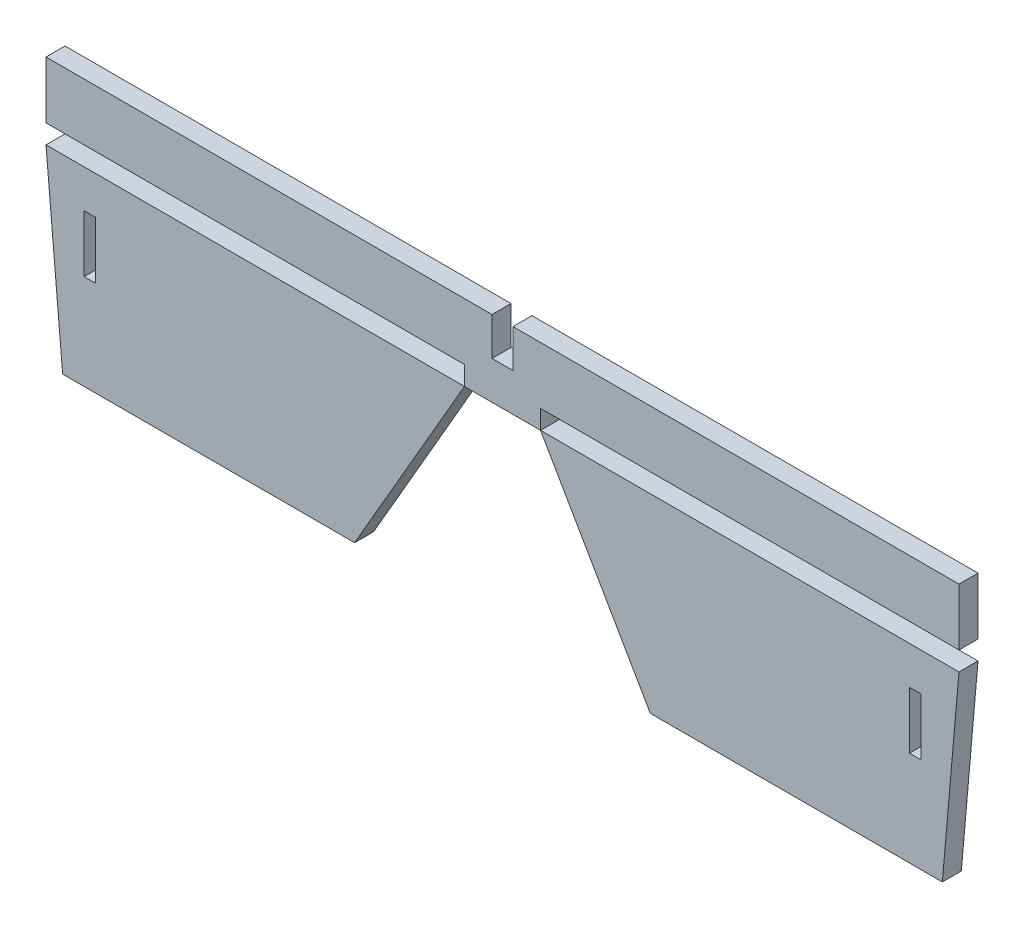
ISO-10303-21;
HEADER;
FILE_DESCRIPTION(('STEP AP214'),'2;1');
FILE_NAME('part.step','',(''),(''),'','','');
FILE_SCHEMA(('AUTOMOTIVE_DESIGN { 1 0 10303 214 1 1 1 1 }'));
ENDSEC;
DATA;
#1=APPLICATION_CONTEXT('core data for automotive mechanical design processes');
#2=APPLICATION_PROTOCOL_DEFINITION('international standard','automotive_design',2000,#1);
#3=PRODUCT_CONTEXT('',#1,'mechanical');
#4=PRODUCT('Part','Part','',(#3));
#5=PRODUCT_RELATED_PRODUCT_CATEGORY('part','',(#4));
#6=PRODUCT_DEFINITION_FORMATION('','',#4);
#7=PRODUCT_DEFINITION_CONTEXT('part definition',#1,'design');
#8=PRODUCT_DEFINITION('design','',#6,#7);
#9=PRODUCT_DEFINITION_SHAPE('','',#8);
#10=(LENGTH_UNIT() NAMED_UNIT(*) SI_UNIT(.MILLI.,.METRE.));
#11=(NAMED_UNIT(*) PLANE_ANGLE_UNIT() SI_UNIT($,.RADIAN.));
#12=(NAMED_UNIT(*) SI_UNIT($,.STERADIAN.) SOLID_ANGLE_UNIT());
#13=UNCERTAINTY_MEASURE_WITH_UNIT(LENGTH_MEASURE(1.E-05),#10,'distance_accuracy_value','');
#14=(GEOMETRIC_REPRESENTATION_CONTEXT(3) GLOBAL_UNCERTAINTY_ASSIGNED_CONTEXT((#13)) GLOBAL_UNIT_ASSIGNED_CONTEXT((#10,
#11,#12)) REPRESENTATION_CONTEXT('',''));
#15=CARTESIAN_POINT('',(0.,0.,0.));
#16=DIRECTION('',(0.,0.,1.));
#17=DIRECTION('',(1.,0.,0.));
#18=AXIS2_PLACEMENT_3D('',#15,#16,#17);
#19=CARTESIAN_POINT('',(0.,-20.,2.5));
#20=DIRECTION('',(0.,1.,0.));
#21=DIRECTION('',(0.,0.,1.));
#22=AXIS2_PLACEMENT_3D('',#19,#20,#21);
#23=PLANE('',#22);
#24=DIRECTION('',(-1.,0.,0.));
#25=VECTOR('',#24,1.);
#26=CARTESIAN_POINT('',(0.,-20.,-2.5));
#27=LINE('',#26,#25);
#28=CARTESIAN_POINT('',(110.,-20.,-2.5));
#29=VERTEX_POINT('',#28);
#30=CARTESIAN_POINT('',(107.,-20.,-2.5));
#31=VERTEX_POINT('',#30);
#32=EDGE_CURVE('E154',#29,#31,#27,.T.);
#33=ORIENTED_EDGE('',*,*,#32,.F.);
#34=DIRECTION('',(0.,0.,-1.));
#35=VECTOR('',#34,1.);
#36=CARTESIAN_POINT('',(110.,-20.,2.5));
#37=LINE('',#36,#35);
#38=CARTESIAN_POINT('',(110.,-20.,2.5));
#39=VERTEX_POINT('',#38);
#40=EDGE_CURVE('E161',#39,#29,#37,.T.);
#41=ORIENTED_EDGE('',*,*,#40,.F.);
#42=DIRECTION('',(-1.,0.,0.));
#43=VECTOR('',#42,1.);
#44=CARTESIAN_POINT('',(0.,-20.,2.5));
#45=LINE('',#44,#43);
#46=CARTESIAN_POINT('',(107.,-20.,2.5));
#47=VERTEX_POINT('',#46);
#48=EDGE_CURVE('E136',#39,#47,#45,.T.);
#49=ORIENTED_EDGE('',*,*,#48,.T.);
#50=DIRECTION('',(0.,0.,-1.));
#51=VECTOR('',#50,1.);
#52=CARTESIAN_POINT('',(107.,-20.,2.5));
#53=LINE('',#52,#51);
#54=EDGE_CURVE('E12',#47,#31,#53,.T.);
#55=ORIENTED_EDGE('',*,*,#54,.T.);
#56=EDGE_LOOP('',(#33,#41,#49,#55));
#57=FACE_BOUND('',#56,.T.);
#58=ADVANCED_FACE('F46',(#57),#23,.F.);
#59=CARTESIAN_POINT('',(107.,0.,2.5));
#60=DIRECTION('',(-1.,0.,0.));
#61=DIRECTION('',(0.,0.,-1.));
#62=AXIS2_PLACEMENT_3D('',#59,#60,#61);
#63=PLANE('',#62);
#64=DIRECTION('',(0.,-1.,0.));
#65=VECTOR('',#64,1.);
#66=CARTESIAN_POINT('',(107.,0.,-2.5));
#67=LINE('',#66,#65);
#68=CARTESIAN_POINT('',(107.,-35.,-2.5));
#69=VERTEX_POINT('',#68);
#70=EDGE_CURVE('E156',#31,#69,#67,.T.);
#71=ORIENTED_EDGE('',*,*,#70,.F.);
#72=ORIENTED_EDGE('',*,*,#54,.F.);
#73=DIRECTION('',(0.,-1.,0.));
#74=VECTOR('',#73,1.);
#75=CARTESIAN_POINT('',(107.,0.,2.5));
#76=LINE('',#75,#74);
#77=CARTESIAN_POINT('',(107.,-35.,2.5));
#78=VERTEX_POINT('',#77);
#79=EDGE_CURVE('E123',#47,#78,#76,.T.);
#80=ORIENTED_EDGE('',*,*,#79,.T.);
#81=DIRECTION('',(0.,0.,-1.));
#82=VECTOR('',#81,1.);
#83=CARTESIAN_POINT('',(107.,-35.,2.5));
#84=LINE('',#83,#82);
#85=EDGE_CURVE('E56',#78,#69,#84,.T.);
#86=ORIENTED_EDGE('',*,*,#85,.T.);
#87=EDGE_LOOP('',(#71,#72,#80,#86));
#88=FACE_BOUND('',#87,.T.);
#89=ADVANCED_FACE('F134',(#88),#63,.F.);
#90=CARTESIAN_POINT('',(0.,-35.,2.5));
#91=DIRECTION('',(0.,1.,0.));
#92=DIRECTION('',(0.,0.,1.));
#93=AXIS2_PLACEMENT_3D('',#90,#91,#92);
#94=PLANE('',#93);
#95=DIRECTION('',(-1.,0.,0.));
#96=VECTOR('',#95,1.);
#97=CARTESIAN_POINT('',(0.,-35.,-2.5));
#98=LINE('',#97,#96);
#99=CARTESIAN_POINT('',(110.,-35.,-2.5));
#100=VERTEX_POINT('',#99);
#101=EDGE_CURVE('E129',#100,#69,#98,.T.);
#102=ORIENTED_EDGE('',*,*,#101,.T.);
#103=ORIENTED_EDGE('',*,*,#85,.F.);
#104=DIRECTION('',(-1.,0.,0.));
#105=VECTOR('',#104,1.);
#106=CARTESIAN_POINT('',(0.,-35.,2.5));
#107=LINE('',#106,#105);
#108=CARTESIAN_POINT('',(110.,-35.,2.5));
#109=VERTEX_POINT('',#108);
#110=EDGE_CURVE('E119',#109,#78,#107,.T.);
#111=ORIENTED_EDGE('',*,*,#110,.F.);
#112=DIRECTION('',(0.,0.,-1.));
#113=VECTOR('',#112,1.);
#114=CARTESIAN_POINT('',(110.,-35.,2.5));
#115=LINE('',#114,#113);
#116=EDGE_CURVE('E132',#109,#100,#115,.T.);
#117=ORIENTED_EDGE('',*,*,#116,.T.);
#118=EDGE_LOOP('',(#102,#103,#111,#117));
#119=FACE_BOUND('',#118,.T.);
#120=ADVANCED_FACE('F128',(#119),#94,.T.);
#121=CARTESIAN_POINT('',(119.956706069067,-10.4948518949548,2.5));
#122=DIRECTION('',(-0.996194698091746,0.0871557427476584,0.));
#123=DIRECTION('',(0.0871557427476584,0.996194698091746,0.));
#124=AXIS2_PLACEMENT_3D('',#121,#122,#123);
#125=PLANE('',#124);
#126=DIRECTION('',(-0.0871557427476584,-0.996194698091746,0.));
#127=VECTOR('',#126,1.);
#128=CARTESIAN_POINT('',(119.956706069067,-10.4948518949548,-2.5));
#129=LINE('',#128,#127);
#130=CARTESIAN_POINT('',(120.,-10.,-2.5));
#131=VERTEX_POINT('',#130);
#132=CARTESIAN_POINT('',(115.625566823704,-60.,-2.5));
#133=VERTEX_POINT('',#132);
#134=EDGE_CURVE('E144',#131,#133,#129,.T.);
#135=ORIENTED_EDGE('',*,*,#134,.F.);
#136=DIRECTION('',(0.,0.,-1.));
#137=VECTOR('',#136,1.);
#138=CARTESIAN_POINT('',(120.,-10.,2.5));
#139=LINE('',#138,#137);
#140=CARTESIAN_POINT('',(120.,-10.,2.5));
#141=VERTEX_POINT('',#140);
#142=EDGE_CURVE('E143',#141,#131,#139,.T.);
#143=ORIENTED_EDGE('',*,*,#142,.F.);
#144=DIRECTION('',(-0.0871557427476584,-0.996194698091746,0.));
#145=VECTOR('',#144,1.);
#146=CARTESIAN_POINT('',(119.956706069067,-10.4948518949548,2.5));
#147=LINE('',#146,#145);
#148=CARTESIAN_POINT('',(115.625566823704,-60.,2.5));
#149=VERTEX_POINT('',#148);
#150=EDGE_CURVE('E160',#141,#149,#147,.T.);
#151=ORIENTED_EDGE('',*,*,#150,.T.);
#152=DIRECTION('',(0.,0.,-1.));
#153=VECTOR('',#152,1.);
#154=CARTESIAN_POINT('',(115.625566823704,-60.,2.5));
#155=LINE('',#154,#153);
#156=EDGE_CURVE('E50',#149,#133,#155,.T.);
#157=ORIENTED_EDGE('',*,*,#156,.T.);
#158=EDGE_LOOP('',(#135,#143,#151,#157));
#159=FACE_BOUND('',#158,.T.);
#160=ADVANCED_FACE('F48',(#159),#125,.F.);
#161=CARTESIAN_POINT('',(0.,-60.,2.5));
#162=DIRECTION('',(0.,1.,0.));
#163=DIRECTION('',(1.,0.,0.));
#164=AXIS2_PLACEMENT_3D('',#161,#162,#163);
#165=PLANE('',#164);
#166=DIRECTION('',(-1.,0.,0.));
#167=VECTOR('',#166,1.);
#168=CARTESIAN_POINT('',(0.,-60.,-2.5));
#169=LINE('',#168,#167);
#170=CARTESIAN_POINT('',(38.8675134594816,-60.,-2.5));
#171=VERTEX_POINT('',#170);
#172=EDGE_CURVE('E147',#133,#171,#169,.T.);
#173=ORIENTED_EDGE('',*,*,#172,.F.);
#174=ORIENTED_EDGE('',*,*,#156,.F.);
#175=DIRECTION('',(-1.,0.,0.));
#176=VECTOR('',#175,1.);
#177=CARTESIAN_POINT('',(0.,-60.,2.5));
#178=LINE('',#177,#176);
#179=CARTESIAN_POINT('',(38.8675134594816,-60.,2.5));
#180=VERTEX_POINT('',#179);
#181=EDGE_CURVE('E104',#149,#180,#178,.T.);
#182=ORIENTED_EDGE('',*,*,#181,.T.);
#183=DIRECTION('',(0.,0.,-1.));
#184=VECTOR('',#183,1.);
#185=CARTESIAN_POINT('',(38.8675134594816,-60.,2.5));
#186=LINE('',#185,#184);
#187=EDGE_CURVE('E168',#180,#171,#186,.T.);
#188=ORIENTED_EDGE('',*,*,#187,.T.);
#189=EDGE_LOOP('',(#173,#174,#182,#188));
#190=FACE_BOUND('',#189,.T.);
#191=ADVANCED_FACE('F190',(#190),#165,.F.);
#192=CARTESIAN_POINT('',(3.16987298107774,1.83012701892218,2.5));
#193=DIRECTION('',(-0.866025403784436,-0.500000000000004,0.));
#194=DIRECTION('',(-0.500000000000004,0.866025403784436,0.));
#195=AXIS2_PLACEMENT_3D('',#192,#193,#194);
#196=PLANE('',#195);
#197=DIRECTION('',(0.500000000000004,-0.866025403784436,0.));
#198=VECTOR('',#197,1.);
#199=CARTESIAN_POINT('',(3.16987298107774,1.83012701892218,-2.5));
#200=LINE('',#199,#198);
#201=CARTESIAN_POINT('',(10.,-10.,-2.5));
#202=VERTEX_POINT('',#201);
#203=EDGE_CURVE('E150',#202,#171,#200,.T.);
#204=ORIENTED_EDGE('',*,*,#203,.T.);
#205=ORIENTED_EDGE('',*,*,#187,.F.);
#206=DIRECTION('',(0.500000000000004,-0.866025403784436,0.));
#207=VECTOR('',#206,1.);
#208=CARTESIAN_POINT('',(3.16987298107774,1.83012701892218,2.5));
#209=LINE('',#208,#207);
#210=CARTESIAN_POINT('',(10.,-10.,2.5));
#211=VERTEX_POINT('',#210);
#212=EDGE_CURVE('E184',#211,#180,#209,.T.);
#213=ORIENTED_EDGE('',*,*,#212,.F.);
#214=DIRECTION('',(0.,0.,-1.));
#215=VECTOR('',#214,1.);
#216=CARTESIAN_POINT('',(10.,-10.,2.5));
#217=LINE('',#216,#215);
#218=EDGE_CURVE('E166',#211,#202,#217,.T.);
#219=ORIENTED_EDGE('',*,*,#218,.T.);
#220=EDGE_LOOP('',(#204,#205,#213,#219));
#221=FACE_BOUND('',#220,.T.);
#222=ADVANCED_FACE('F189',(#221),#196,.T.);
#223=CARTESIAN_POINT('',(0.,-10.,2.5));
#224=DIRECTION('',(0.,1.,0.));
#225=DIRECTION('',(0.,0.,1.));
#226=AXIS2_PLACEMENT_3D('',#223,#224,#225);
#227=PLANE('',#226);
#228=DIRECTION('',(-1.,0.,0.));
#229=VECTOR('',#228,1.);
#230=CARTESIAN_POINT('',(0.,-10.,-2.5));
#231=LINE('',#230,#229);
#232=EDGE_CURVE('E152',#131,#202,#231,.T.);
#233=ORIENTED_EDGE('',*,*,#232,.T.);
#234=ORIENTED_EDGE('',*,*,#218,.F.);
#235=DIRECTION('',(-1.,0.,0.));
#236=VECTOR('',#235,1.);
#237=CARTESIAN_POINT('',(0.,-10.,2.5));
#238=LINE('',#237,#236);
#239=EDGE_CURVE('E138',#141,#211,#238,.T.);
#240=ORIENTED_EDGE('',*,*,#239,.F.);
#241=ORIENTED_EDGE('',*,*,#142,.T.);
#242=EDGE_LOOP('',(#233,#234,#240,#241));
#243=FACE_BOUND('',#242,.T.);
#244=ADVANCED_FACE('F182',(#243),#227,.T.);
#245=CARTESIAN_POINT('',(110.,0.,2.5));
#246=DIRECTION('',(-1.,0.,0.));
#247=DIRECTION('',(0.,0.,-1.));
#248=AXIS2_PLACEMENT_3D('',#245,#246,#247);
#249=PLANE('',#248);
#250=DIRECTION('',(0.,-1.,0.));
#251=VECTOR('',#250,1.);
#252=CARTESIAN_POINT('',(110.,0.,-2.5));
#253=LINE('',#252,#251);
#254=EDGE_CURVE('E91',#29,#100,#253,.T.);
#255=ORIENTED_EDGE('',*,*,#254,.T.);
#256=ORIENTED_EDGE('',*,*,#116,.F.);
#257=DIRECTION('',(0.,-1.,0.));
#258=VECTOR('',#257,1.);
#259=CARTESIAN_POINT('',(110.,0.,2.5));
#260=LINE('',#259,#258);
#261=EDGE_CURVE('E65',#39,#109,#260,.T.);
#262=ORIENTED_EDGE('',*,*,#261,.F.);
#263=ORIENTED_EDGE('',*,*,#40,.T.);
#264=EDGE_LOOP('',(#255,#256,#262,#263));
#265=FACE_BOUND('',#264,.T.);
#266=ADVANCED_FACE('F208',(#265),#249,.T.);
#267=CARTESIAN_POINT('',(0.,0.,2.5));
#268=DIRECTION('',(0.,0.,1.));
#269=DIRECTION('',(-1.,0.,0.));
#270=AXIS2_PLACEMENT_3D('',#267,#268,#269);
#271=PLANE('',#270);
#272=ORIENTED_EDGE('',*,*,#150,.F.);
#273=ORIENTED_EDGE('',*,*,#239,.T.);
#274=ORIENTED_EDGE('',*,*,#212,.T.);
#275=ORIENTED_EDGE('',*,*,#181,.F.);
#276=EDGE_LOOP('',(#272,#273,#274,#275));
#277=FACE_BOUND('',#276,.T.);
#278=ORIENTED_EDGE('',*,*,#48,.F.);
#279=ORIENTED_EDGE('',*,*,#261,.T.);
#280=ORIENTED_EDGE('',*,*,#110,.T.);
#281=ORIENTED_EDGE('',*,*,#79,.F.);
#282=EDGE_LOOP('',(#278,#279,#280,#281));
#283=FACE_BOUND('',#282,.T.);
#284=ADVANCED_FACE('F121',(#277,#283),#271,.T.);
#285=CARTESIAN_POINT('',(0.,0.,-2.5));
#286=DIRECTION('',(0.,0.,1.));
#287=DIRECTION('',(-1.,0.,0.));
#288=AXIS2_PLACEMENT_3D('',#285,#286,#287);
#289=PLANE('',#288);
#290=ORIENTED_EDGE('',*,*,#134,.T.);
#291=ORIENTED_EDGE('',*,*,#172,.T.);
#292=ORIENTED_EDGE('',*,*,#203,.F.);
#293=ORIENTED_EDGE('',*,*,#232,.F.);
#294=EDGE_LOOP('',(#290,#291,#292,#293));
#295=FACE_BOUND('',#294,.T.);
#296=ORIENTED_EDGE('',*,*,#32,.T.);
#297=ORIENTED_EDGE('',*,*,#70,.T.);
#298=ORIENTED_EDGE('',*,*,#101,.F.);
#299=ORIENTED_EDGE('',*,*,#254,.F.);
#300=EDGE_LOOP('',(#296,#297,#298,#299));
#301=FACE_BOUND('',#300,.T.);
#302=ADVANCED_FACE('F178',(#295,#301),#289,.F.);
#303=CLOSED_SHELL('',(#58,#89,#120,#160,#191,#222,#244,#266,#284,#302));
#304=MANIFOLD_SOLID_BREP('B2',#303);
#305=CARTESIAN_POINT('',(0.,-20.,2.5));
#306=DIRECTION('',(0.,1.,0.));
#307=DIRECTION('',(0.,0.,1.));
#308=AXIS2_PLACEMENT_3D('',#305,#306,#307);
#309=PLANE('',#308);
#310=DIRECTION('',(1.,0.,0.));
#311=VECTOR('',#310,1.);
#312=CARTESIAN_POINT('',(0.,-20.,-2.5));
#313=LINE('',#312,#311);
#314=CARTESIAN_POINT('',(-110.,-20.,-2.5));
#315=VERTEX_POINT('',#314);
#316=CARTESIAN_POINT('',(-107.,-20.,-2.5));
#317=VERTEX_POINT('',#316);
#318=EDGE_CURVE('E397',#315,#317,#313,.T.);
#319=ORIENTED_EDGE('',*,*,#318,.T.);
#320=DIRECTION('',(0.,0.,-1.));
#321=VECTOR('',#320,1.);
#322=CARTESIAN_POINT('',(-107.,-20.,2.5));
#323=LINE('',#322,#321);
#324=CARTESIAN_POINT('',(-107.,-20.,2.5));
#325=VERTEX_POINT('',#324);
#326=EDGE_CURVE('E44',#325,#317,#323,.T.);
#327=ORIENTED_EDGE('',*,*,#326,.F.);
#328=DIRECTION('',(1.,0.,0.));
#329=VECTOR('',#328,1.);
#330=CARTESIAN_POINT('',(0.,-20.,2.5));
#331=LINE('',#330,#329);
#332=CARTESIAN_POINT('',(-110.,-20.,2.5));
#333=VERTEX_POINT('',#332);
#334=EDGE_CURVE('E368',#333,#325,#331,.T.);
#335=ORIENTED_EDGE('',*,*,#334,.F.);
#336=DIRECTION('',(0.,0.,-1.));
#337=VECTOR('',#336,1.);
#338=CARTESIAN_POINT('',(-110.,-20.,2.5));
#339=LINE('',#338,#337);
#340=EDGE_CURVE('E307',#333,#315,#339,.T.);
#341=ORIENTED_EDGE('',*,*,#340,.T.);
#342=EDGE_LOOP('',(#319,#327,#335,#341));
#343=FACE_BOUND('',#342,.T.);
#344=ADVANCED_FACE('F288',(#343),#309,.F.);
#345=CARTESIAN_POINT('',(-107.,0.,2.5));
#346=DIRECTION('',(1.,0.,0.));
#347=DIRECTION('',(0.,0.,-1.));
#348=AXIS2_PLACEMENT_3D('',#345,#346,#347);
#349=PLANE('',#348);
#350=DIRECTION('',(0.,-1.,0.));
#351=VECTOR('',#350,1.);
#352=CARTESIAN_POINT('',(-107.,0.,-2.5));
#353=LINE('',#352,#351);
#354=CARTESIAN_POINT('',(-107.,-35.,-2.5));
#355=VERTEX_POINT('',#354);
#356=EDGE_CURVE('E374',#317,#355,#353,.T.);
#357=ORIENTED_EDGE('',*,*,#356,.T.);
#358=DIRECTION('',(0.,0.,-1.));
#359=VECTOR('',#358,1.);
#360=CARTESIAN_POINT('',(-107.,-35.,2.5));
#361=LINE('',#360,#359);
#362=CARTESIAN_POINT('',(-107.,-35.,2.5));
#363=VERTEX_POINT('',#362);
#364=EDGE_CURVE('E298',#363,#355,#361,.T.);
#365=ORIENTED_EDGE('',*,*,#364,.F.);
#366=DIRECTION('',(0.,-1.,0.));
#367=VECTOR('',#366,1.);
#368=CARTESIAN_POINT('',(-107.,0.,2.5));
#369=LINE('',#368,#367);
#370=EDGE_CURVE('E362',#325,#363,#369,.T.);
#371=ORIENTED_EDGE('',*,*,#370,.F.);
#372=ORIENTED_EDGE('',*,*,#326,.T.);
#373=EDGE_LOOP('',(#357,#365,#371,#372));
#374=FACE_BOUND('',#373,.T.);
#375=ADVANCED_FACE('F373',(#374),#349,.F.);
#376=CARTESIAN_POINT('',(0.,-35.,2.5));
#377=DIRECTION('',(0.,1.,0.));
#378=DIRECTION('',(0.,0.,1.));
#379=AXIS2_PLACEMENT_3D('',#376,#377,#378);
#380=PLANE('',#379);
#381=DIRECTION('',(1.,0.,0.));
#382=VECTOR('',#381,1.);
#383=CARTESIAN_POINT('',(0.,-35.,-2.5));
#384=LINE('',#383,#382);
#385=CARTESIAN_POINT('',(-110.,-35.,-2.5));
#386=VERTEX_POINT('',#385);
#387=EDGE_CURVE('E400',#386,#355,#384,.T.);
#388=ORIENTED_EDGE('',*,*,#387,.F.);
#389=DIRECTION('',(0.,0.,-1.));
#390=VECTOR('',#389,1.);
#391=CARTESIAN_POINT('',(-110.,-35.,2.5));
#392=LINE('',#391,#390);
#393=CARTESIAN_POINT('',(-110.,-35.,2.5));
#394=VERTEX_POINT('',#393);
#395=EDGE_CURVE('E333',#394,#386,#392,.T.);
#396=ORIENTED_EDGE('',*,*,#395,.F.);
#397=DIRECTION('',(1.,0.,0.));
#398=VECTOR('',#397,1.);
#399=CARTESIAN_POINT('',(0.,-35.,2.5));
#400=LINE('',#399,#398);
#401=EDGE_CURVE('E367',#394,#363,#400,.T.);
#402=ORIENTED_EDGE('',*,*,#401,.T.);
#403=ORIENTED_EDGE('',*,*,#364,.T.);
#404=EDGE_LOOP('',(#388,#396,#402,#403));
#405=FACE_BOUND('',#404,.T.);
#406=ADVANCED_FACE('F378',(#405),#380,.T.);
#407=CARTESIAN_POINT('',(-119.956706069067,-10.4948518949548,2.5));
#408=DIRECTION('',(0.996194698091746,0.0871557427476584,0.));
#409=DIRECTION('',(-0.0871557427476584,0.996194698091746,0.));
#410=AXIS2_PLACEMENT_3D('',#407,#408,#409);
#411=PLANE('',#410);
#412=DIRECTION('',(0.0871557427476584,-0.996194698091746,0.));
#413=VECTOR('',#412,1.);
#414=CARTESIAN_POINT('',(-119.956706069067,-10.4948518949548,-2.5));
#415=LINE('',#414,#413);
#416=CARTESIAN_POINT('',(-120.,-10.,-2.5));
#417=VERTEX_POINT('',#416);
#418=CARTESIAN_POINT('',(-115.625566823704,-60.,-2.5));
#419=VERTEX_POINT('',#418);
#420=EDGE_CURVE('E385',#417,#419,#415,.T.);
#421=ORIENTED_EDGE('',*,*,#420,.T.);
#422=DIRECTION('',(0.,0.,-1.));
#423=VECTOR('',#422,1.);
#424=CARTESIAN_POINT('',(-115.625566823704,-60.,2.5));
#425=LINE('',#424,#423);
#426=CARTESIAN_POINT('',(-115.625566823704,-60.,2.5));
#427=VERTEX_POINT('',#426);
#428=EDGE_CURVE('E292',#427,#419,#425,.T.);
#429=ORIENTED_EDGE('',*,*,#428,.F.);
#430=DIRECTION('',(0.0871557427476584,-0.996194698091746,0.));
#431=VECTOR('',#430,1.);
#432=CARTESIAN_POINT('',(-119.956706069067,-10.4948518949548,2.5));
#433=LINE('',#432,#431);
#434=CARTESIAN_POINT('',(-120.,-10.,2.5));
#435=VERTEX_POINT('',#434);
#436=EDGE_CURVE('E405',#435,#427,#433,.T.);
#437=ORIENTED_EDGE('',*,*,#436,.F.);
#438=DIRECTION('',(0.,0.,-1.));
#439=VECTOR('',#438,1.);
#440=CARTESIAN_POINT('',(-120.,-10.,2.5));
#441=LINE('',#440,#439);
#442=EDGE_CURVE('E381',#435,#417,#441,.T.);
#443=ORIENTED_EDGE('',*,*,#442,.T.);
#444=EDGE_LOOP('',(#421,#429,#437,#443));
#445=FACE_BOUND('',#444,.T.);
#446=ADVANCED_FACE('F290',(#445),#411,.F.);
#447=CARTESIAN_POINT('',(0.,-60.,2.5));
#448=DIRECTION('',(0.,1.,0.));
#449=DIRECTION('',(-1.,0.,0.));
#450=AXIS2_PLACEMENT_3D('',#447,#448,#449);
#451=PLANE('',#450);
#452=DIRECTION('',(1.,0.,0.));
#453=VECTOR('',#452,1.);
#454=CARTESIAN_POINT('',(0.,-60.,-2.5));
#455=LINE('',#454,#453);
#456=CARTESIAN_POINT('',(-38.8675134594816,-60.,-2.5));
#457=VERTEX_POINT('',#456);
#458=EDGE_CURVE('E388',#419,#457,#455,.T.);
#459=ORIENTED_EDGE('',*,*,#458,.T.);
#460=DIRECTION('',(0.,0.,-1.));
#461=VECTOR('',#460,1.);
#462=CARTESIAN_POINT('',(-38.8675134594816,-60.,2.5));
#463=LINE('',#462,#461);
#464=CARTESIAN_POINT('',(-38.8675134594816,-60.,2.5));
#465=VERTEX_POINT('',#464);
#466=EDGE_CURVE('E410',#465,#457,#463,.T.);
#467=ORIENTED_EDGE('',*,*,#466,.F.);
#468=DIRECTION('',(1.,0.,0.));
#469=VECTOR('',#468,1.);
#470=CARTESIAN_POINT('',(0.,-60.,2.5));
#471=LINE('',#470,#469);
#472=EDGE_CURVE('E346',#427,#465,#471,.T.);
#473=ORIENTED_EDGE('',*,*,#472,.F.);
#474=ORIENTED_EDGE('',*,*,#428,.T.);
#475=EDGE_LOOP('',(#459,#467,#473,#474));
#476=FACE_BOUND('',#475,.T.);
#477=ADVANCED_FACE('F415',(#476),#451,.F.);
#478=CARTESIAN_POINT('',(-3.16987298107774,1.83012701892218,2.5));
#479=DIRECTION('',(0.866025403784436,-0.500000000000004,0.));
#480=DIRECTION('',(0.500000000000004,0.866025403784436,0.));
#481=AXIS2_PLACEMENT_3D('',#478,#479,#480);
#482=PLANE('',#481);
#483=DIRECTION('',(-0.500000000000004,-0.866025403784436,0.));
#484=VECTOR('',#483,1.);
#485=CARTESIAN_POINT('',(-3.16987298107774,1.83012701892218,-2.5));
#486=LINE('',#485,#484);
#487=CARTESIAN_POINT('',(-10.,-10.,-2.5));
#488=VERTEX_POINT('',#487);
#489=EDGE_CURVE('E391',#488,#457,#486,.T.);
#490=ORIENTED_EDGE('',*,*,#489,.F.);
#491=DIRECTION('',(0.,0.,-1.));
#492=VECTOR('',#491,1.);
#493=CARTESIAN_POINT('',(-10.,-10.,2.5));
#494=LINE('',#493,#492);
#495=CARTESIAN_POINT('',(-10.,-10.,2.5));
#496=VERTEX_POINT('',#495);
#497=EDGE_CURVE('E409',#496,#488,#494,.T.);
#498=ORIENTED_EDGE('',*,*,#497,.F.);
#499=DIRECTION('',(-0.500000000000004,-0.866025403784436,0.));
#500=VECTOR('',#499,1.);
#501=CARTESIAN_POINT('',(-3.16987298107774,1.83012701892218,2.5));
#502=LINE('',#501,#500);
#503=EDGE_CURVE('E456',#496,#465,#502,.T.);
#504=ORIENTED_EDGE('',*,*,#503,.T.);
#505=ORIENTED_EDGE('',*,*,#466,.T.);
#506=EDGE_LOOP('',(#490,#498,#504,#505));
#507=FACE_BOUND('',#506,.T.);
#508=ADVANCED_FACE('F429',(#507),#482,.T.);
#509=CARTESIAN_POINT('',(0.,-10.,2.5));
#510=DIRECTION('',(0.,1.,0.));
#511=DIRECTION('',(0.,0.,1.));
#512=AXIS2_PLACEMENT_3D('',#509,#510,#511);
#513=PLANE('',#512);
#514=DIRECTION('',(1.,0.,0.));
#515=VECTOR('',#514,1.);
#516=CARTESIAN_POINT('',(0.,-10.,-2.5));
#517=LINE('',#516,#515);
#518=EDGE_CURVE('E394',#417,#488,#517,.T.);
#519=ORIENTED_EDGE('',*,*,#518,.F.);
#520=ORIENTED_EDGE('',*,*,#442,.F.);
#521=DIRECTION('',(1.,0.,0.));
#522=VECTOR('',#521,1.);
#523=CARTESIAN_POINT('',(0.,-10.,2.5));
#524=LINE('',#523,#522);
#525=EDGE_CURVE('E427',#435,#496,#524,.T.);
#526=ORIENTED_EDGE('',*,*,#525,.T.);
#527=ORIENTED_EDGE('',*,*,#497,.T.);
#528=EDGE_LOOP('',(#519,#520,#526,#527));
#529=FACE_BOUND('',#528,.T.);
#530=ADVANCED_FACE('F424',(#529),#513,.T.);
#531=CARTESIAN_POINT('',(-110.,0.,2.5));
#532=DIRECTION('',(1.,0.,0.));
#533=DIRECTION('',(0.,0.,-1.));
#534=AXIS2_PLACEMENT_3D('',#531,#532,#533);
#535=PLANE('',#534);
#536=DIRECTION('',(0.,-1.,0.));
#537=VECTOR('',#536,1.);
#538=CARTESIAN_POINT('',(-110.,0.,-2.5));
#539=LINE('',#538,#537);
#540=EDGE_CURVE('E402',#315,#386,#539,.T.);
#541=ORIENTED_EDGE('',*,*,#540,.F.);
#542=ORIENTED_EDGE('',*,*,#340,.F.);
#543=DIRECTION('',(0.,-1.,0.));
#544=VECTOR('',#543,1.);
#545=CARTESIAN_POINT('',(-110.,0.,2.5));
#546=LINE('',#545,#544);
#547=EDGE_CURVE('E379',#333,#394,#546,.T.);
#548=ORIENTED_EDGE('',*,*,#547,.T.);
#549=ORIENTED_EDGE('',*,*,#395,.T.);
#550=EDGE_LOOP('',(#541,#542,#548,#549));
#551=FACE_BOUND('',#550,.T.);
#552=ADVANCED_FACE('F436',(#551),#535,.T.);
#553=CARTESIAN_POINT('',(0.,0.,2.5));
#554=DIRECTION('',(0.,0.,1.));
#555=DIRECTION('',(1.,0.,0.));
#556=AXIS2_PLACEMENT_3D('',#553,#554,#555);
#557=PLANE('',#556);
#558=ORIENTED_EDGE('',*,*,#436,.T.);
#559=ORIENTED_EDGE('',*,*,#472,.T.);
#560=ORIENTED_EDGE('',*,*,#503,.F.);
#561=ORIENTED_EDGE('',*,*,#525,.F.);
#562=EDGE_LOOP('',(#558,#559,#560,#561));
#563=FACE_BOUND('',#562,.T.);
#564=ORIENTED_EDGE('',*,*,#334,.T.);
#565=ORIENTED_EDGE('',*,*,#370,.T.);
#566=ORIENTED_EDGE('',*,*,#401,.F.);
#567=ORIENTED_EDGE('',*,*,#547,.F.);
#568=EDGE_LOOP('',(#564,#565,#566,#567));
#569=FACE_BOUND('',#568,.T.);
#570=ADVANCED_FACE('F364',(#563,#569),#557,.T.);
#571=CARTESIAN_POINT('',(0.,0.,-2.5));
#572=DIRECTION('',(0.,0.,1.));
#573=DIRECTION('',(1.,0.,0.));
#574=AXIS2_PLACEMENT_3D('',#571,#572,#573);
#575=PLANE('',#574);
#576=ORIENTED_EDGE('',*,*,#420,.F.);
#577=ORIENTED_EDGE('',*,*,#518,.T.);
#578=ORIENTED_EDGE('',*,*,#489,.T.);
#579=ORIENTED_EDGE('',*,*,#458,.F.);
#580=EDGE_LOOP('',(#576,#577,#578,#579));
#581=FACE_BOUND('',#580,.T.);
#582=ORIENTED_EDGE('',*,*,#318,.F.);
#583=ORIENTED_EDGE('',*,*,#540,.T.);
#584=ORIENTED_EDGE('',*,*,#387,.T.);
#585=ORIENTED_EDGE('',*,*,#356,.F.);
#586=EDGE_LOOP('',(#582,#583,#584,#585));
#587=FACE_BOUND('',#586,.T.);
#588=ADVANCED_FACE('F421',(#581,#587),#575,.F.);
#589=CLOSED_SHELL('',(#344,#375,#406,#446,#477,#508,#530,#552,#570,#588));
#590=MANIFOLD_SOLID_BREP('B6',#589);
#591=CARTESIAN_POINT('',(0.,-5.,2.5));
#592=DIRECTION('',(0.,1.,0.));
#593=DIRECTION('',(0.,0.,1.));
#594=AXIS2_PLACEMENT_3D('',#591,#592,#593);
#595=PLANE('',#594);
#596=DIRECTION('',(1.,0.,0.));
#597=VECTOR('',#596,1.);
#598=CARTESIAN_POINT('',(0.,-5.,-2.5));
#599=LINE('',#598,#597);
#600=CARTESIAN_POINT('',(-120.,-5.,-2.5));
#601=VERTEX_POINT('',#600);
#602=CARTESIAN_POINT('',(-10.,-5.,-2.5));
#603=VERTEX_POINT('',#602);
#604=EDGE_CURVE('E608',#601,#603,#599,.T.);
#605=ORIENTED_EDGE('',*,*,#604,.T.);
#606=DIRECTION('',(0.,0.,-1.));
#607=VECTOR('',#606,1.);
#608=CARTESIAN_POINT('',(-10.,-5.,2.5));
#609=LINE('',#608,#607);
#610=CARTESIAN_POINT('',(-10.,-5.,2.5));
#611=VERTEX_POINT('',#610);
#612=EDGE_CURVE('E286',#611,#603,#609,.T.);
#613=ORIENTED_EDGE('',*,*,#612,.F.);
#614=DIRECTION('',(1.,0.,0.));
#615=VECTOR('',#614,1.);
#616=CARTESIAN_POINT('',(0.,-5.,2.5));
#617=LINE('',#616,#615);
#618=CARTESIAN_POINT('',(-120.,-5.,2.5));
#619=VERTEX_POINT('',#618);
#620=EDGE_CURVE('E624',#619,#611,#617,.T.);
#621=ORIENTED_EDGE('',*,*,#620,.F.);
#622=DIRECTION('',(0.,0.,-1.));
#623=VECTOR('',#622,1.);
#624=CARTESIAN_POINT('',(-120.,-5.,2.5));
#625=LINE('',#624,#623);
#626=EDGE_CURVE('E604',#619,#601,#625,.T.);
#627=ORIENTED_EDGE('',*,*,#626,.T.);
#628=EDGE_LOOP('',(#605,#613,#621,#627));
#629=FACE_BOUND('',#628,.T.);
#630=ADVANCED_FACE('F521',(#629),#595,.F.);
#631=CARTESIAN_POINT('',(-10.,0.,2.5));
#632=DIRECTION('',(1.,0.,0.));
#633=DIRECTION('',(0.,1.,0.));
#634=AXIS2_PLACEMENT_3D('',#631,#632,#633);
#635=PLANE('',#634);
#636=DIRECTION('',(0.,-1.,0.));
#637=VECTOR('',#636,1.);
#638=CARTESIAN_POINT('',(-10.,0.,-2.5));
#639=LINE('',#638,#637);
#640=CARTESIAN_POINT('',(-10.,-10.,-2.5));
#641=VERTEX_POINT('',#640);
#642=EDGE_CURVE('E611',#603,#641,#639,.T.);
#643=ORIENTED_EDGE('',*,*,#642,.T.);
#644=DIRECTION('',(0.,0.,-1.));
#645=VECTOR('',#644,1.);
#646=CARTESIAN_POINT('',(-10.,-10.,2.5));
#647=LINE('',#646,#645);
#648=CARTESIAN_POINT('',(-10.,-10.,2.5));
#649=VERTEX_POINT('',#648);
#650=EDGE_CURVE('E529',#649,#641,#647,.T.);
#651=ORIENTED_EDGE('',*,*,#650,.F.);
#652=DIRECTION('',(0.,-1.,0.));
#653=VECTOR('',#652,1.);
#654=CARTESIAN_POINT('',(-10.,0.,2.5));
#655=LINE('',#654,#653);
#656=EDGE_CURVE('E571',#611,#649,#655,.T.);
#657=ORIENTED_EDGE('',*,*,#656,.F.);
#658=ORIENTED_EDGE('',*,*,#612,.T.);
#659=EDGE_LOOP('',(#643,#651,#657,#658));
#660=FACE_BOUND('',#659,.T.);
#661=ADVANCED_FACE('F744',(#660),#635,.F.);
#662=CARTESIAN_POINT('',(0.,-10.,2.5));
#663=DIRECTION('',(0.,1.,0.));
#664=DIRECTION('',(0.,0.,1.));
#665=AXIS2_PLACEMENT_3D('',#662,#663,#664);
#666=PLANE('',#665);
#667=DIRECTION('',(1.,0.,0.));
#668=VECTOR('',#667,1.);
#669=CARTESIAN_POINT('',(0.,-10.,-2.5));
#670=LINE('',#669,#668);
#671=CARTESIAN_POINT('',(10.,-10.,-2.5));
#672=VERTEX_POINT('',#671);
#673=EDGE_CURVE('E614',#641,#672,#670,.T.);
#674=ORIENTED_EDGE('',*,*,#673,.T.);
#675=DIRECTION('',(0.,0.,-1.));
#676=VECTOR('',#675,1.);
#677=CARTESIAN_POINT('',(10.,-10.,2.5));
#678=LINE('',#677,#676);
#679=CARTESIAN_POINT('',(10.,-10.,2.5));
#680=VERTEX_POINT('',#679);
#681=EDGE_CURVE('E679',#680,#672,#678,.T.);
#682=ORIENTED_EDGE('',*,*,#681,.F.);
#683=DIRECTION('',(1.,0.,0.));
#684=VECTOR('',#683,1.);
#685=CARTESIAN_POINT('',(0.,-10.,2.5));
#686=LINE('',#685,#684);
#687=EDGE_CURVE('E636',#649,#680,#686,.T.);
#688=ORIENTED_EDGE('',*,*,#687,.F.);
#689=ORIENTED_EDGE('',*,*,#650,.T.);
#690=EDGE_LOOP('',(#674,#682,#688,#689));
#691=FACE_BOUND('',#690,.T.);
#692=ADVANCED_FACE('F631',(#691),#666,.F.);
#693=CARTESIAN_POINT('',(0.,0.,2.5));
#694=DIRECTION('',(0.,1.,0.));
#695=DIRECTION('',(0.,0.,1.));
#696=AXIS2_PLACEMENT_3D('',#693,#694,#695);
#697=PLANE('',#696);
#698=DIRECTION('',(1.,0.,0.));
#699=VECTOR('',#698,1.);
#700=CARTESIAN_POINT('',(0.,0.,-2.5));
#701=LINE('',#700,#699);
#702=CARTESIAN_POINT('',(-2.75,0.,-2.5));
#703=VERTEX_POINT('',#702);
#704=CARTESIAN_POINT('',(2.75,0.,-2.5));
#705=VERTEX_POINT('',#704);
#706=EDGE_CURVE('E617',#703,#705,#701,.T.);
#707=ORIENTED_EDGE('',*,*,#706,.F.);
#708=DIRECTION('',(0.,0.,-1.));
#709=VECTOR('',#708,1.);
#710=CARTESIAN_POINT('',(-2.75,0.,2.5));
#711=LINE('',#710,#709);
#712=CARTESIAN_POINT('',(-2.75,0.,2.5));
#713=VERTEX_POINT('',#712);
#714=EDGE_CURVE('E593',#713,#703,#711,.T.);
#715=ORIENTED_EDGE('',*,*,#714,.F.);
#716=DIRECTION('',(1.,0.,0.));
#717=VECTOR('',#716,1.);
#718=CARTESIAN_POINT('',(0.,0.,2.5));
#719=LINE('',#718,#717);
#720=CARTESIAN_POINT('',(2.75,0.,2.5));
#721=VERTEX_POINT('',#720);
#722=EDGE_CURVE('E600',#713,#721,#719,.T.);
#723=ORIENTED_EDGE('',*,*,#722,.T.);
#724=DIRECTION('',(0.,0.,-1.));
#725=VECTOR('',#724,1.);
#726=CARTESIAN_POINT('',(2.75,0.,2.5));
#727=LINE('',#726,#725);
#728=EDGE_CURVE('E676',#721,#705,#727,.T.);
#729=ORIENTED_EDGE('',*,*,#728,.T.);
#730=EDGE_LOOP('',(#707,#715,#723,#729));
#731=FACE_BOUND('',#730,.T.);
#732=ADVANCED_FACE('F687',(#731),#697,.T.);
#733=CARTESIAN_POINT('',(-2.75,0.,2.5));
#734=DIRECTION('',(1.,0.,0.));
#735=DIRECTION('',(0.,1.,0.));
#736=AXIS2_PLACEMENT_3D('',#733,#734,#735);
#737=PLANE('',#736);
#738=DIRECTION('',(0.,-1.,0.));
#739=VECTOR('',#738,1.);
#740=CARTESIAN_POINT('',(-2.75,0.,-2.5));
#741=LINE('',#740,#739);
#742=CARTESIAN_POINT('',(-2.75,10.,-2.5));
#743=VERTEX_POINT('',#742);
#744=EDGE_CURVE('E588',#743,#703,#741,.T.);
#745=ORIENTED_EDGE('',*,*,#744,.F.);
#746=DIRECTION('',(0.,0.,-1.));
#747=VECTOR('',#746,1.);
#748=CARTESIAN_POINT('',(-2.75,10.,2.5));
#749=LINE('',#748,#747);
#750=CARTESIAN_POINT('',(-2.75,10.,2.5));
#751=VERTEX_POINT('',#750);
#752=EDGE_CURVE('E583',#751,#743,#749,.T.);
#753=ORIENTED_EDGE('',*,*,#752,.F.);
#754=DIRECTION('',(0.,-1.,0.));
#755=VECTOR('',#754,1.);
#756=CARTESIAN_POINT('',(-2.75,0.,2.5));
#757=LINE('',#756,#755);
#758=EDGE_CURVE('E586',#751,#713,#757,.T.);
#759=ORIENTED_EDGE('',*,*,#758,.T.);
#760=ORIENTED_EDGE('',*,*,#714,.T.);
#761=EDGE_LOOP('',(#745,#753,#759,#760));
#762=FACE_BOUND('',#761,.T.);
#763=ADVANCED_FACE('F585',(#762),#737,.T.);
#764=CARTESIAN_POINT('',(0.,10.,2.5));
#765=DIRECTION('',(0.,1.,0.));
#766=DIRECTION('',(0.,0.,1.));
#767=AXIS2_PLACEMENT_3D('',#764,#765,#766);
#768=PLANE('',#767);
#769=DIRECTION('',(1.,0.,0.));
#770=VECTOR('',#769,1.);
#771=CARTESIAN_POINT('',(0.,10.,-2.5));
#772=LINE('',#771,#770);
#773=CARTESIAN_POINT('',(-120.,10.,-2.5));
#774=VERTEX_POINT('',#773);
#775=EDGE_CURVE('E621',#774,#743,#772,.T.);
#776=ORIENTED_EDGE('',*,*,#775,.F.);
#777=DIRECTION('',(0.,0.,-1.));
#778=VECTOR('',#777,1.);
#779=CARTESIAN_POINT('',(-120.,10.,2.5));
#780=LINE('',#779,#778);
#781=CARTESIAN_POINT('',(-120.,10.,2.5));
#782=VERTEX_POINT('',#781);
#783=EDGE_CURVE('E560',#782,#774,#780,.T.);
#784=ORIENTED_EDGE('',*,*,#783,.F.);
#785=DIRECTION('',(1.,0.,0.));
#786=VECTOR('',#785,1.);
#787=CARTESIAN_POINT('',(0.,10.,2.5));
#788=LINE('',#787,#786);
#789=EDGE_CURVE('E597',#782,#751,#788,.T.);
#790=ORIENTED_EDGE('',*,*,#789,.T.);
#791=ORIENTED_EDGE('',*,*,#752,.T.);
#792=EDGE_LOOP('',(#776,#784,#790,#791));
#793=FACE_BOUND('',#792,.T.);
#794=ADVANCED_FACE('F602',(#793),#768,.T.);
#795=CARTESIAN_POINT('',(-120.,0.,2.5));
#796=DIRECTION('',(1.,0.,0.));
#797=DIRECTION('',(0.,0.,-1.));
#798=AXIS2_PLACEMENT_3D('',#795,#796,#797);
#799=PLANE('',#798);
#800=DIRECTION('',(0.,-1.,0.));
#801=VECTOR('',#800,1.);
#802=CARTESIAN_POINT('',(-120.,0.,-2.5));
#803=LINE('',#802,#801);
#804=EDGE_CURVE('E563',#774,#601,#803,.T.);
#805=ORIENTED_EDGE('',*,*,#804,.T.);
#806=ORIENTED_EDGE('',*,*,#626,.F.);
#807=DIRECTION('',(0.,-1.,0.));
#808=VECTOR('',#807,1.);
#809=CARTESIAN_POINT('',(-120.,0.,2.5));
#810=LINE('',#809,#808);
#811=EDGE_CURVE('E537',#782,#619,#810,.T.);
#812=ORIENTED_EDGE('',*,*,#811,.F.);
#813=ORIENTED_EDGE('',*,*,#783,.T.);
#814=EDGE_LOOP('',(#805,#806,#812,#813));
#815=FACE_BOUND('',#814,.T.);
#816=ADVANCED_FACE('F751',(#815),#799,.F.);
#817=CARTESIAN_POINT('',(0.,0.,2.5));
#818=DIRECTION('',(0.,0.,1.));
#819=DIRECTION('',(1.,0.,0.));
#820=AXIS2_PLACEMENT_3D('',#817,#818,#819);
#821=PLANE('',#820);
#822=ORIENTED_EDGE('',*,*,#620,.T.);
#823=ORIENTED_EDGE('',*,*,#656,.T.);
#824=ORIENTED_EDGE('',*,*,#687,.T.);
#825=DIRECTION('',(0.,-1.,0.));
#826=VECTOR('',#825,1.);
#827=CARTESIAN_POINT('',(10.,0.,2.5));
#828=LINE('',#827,#826);
#829=CARTESIAN_POINT('',(10.,-5.,2.5));
#830=VERTEX_POINT('',#829);
#831=EDGE_CURVE('E700',#830,#680,#828,.T.);
#832=ORIENTED_EDGE('',*,*,#831,.F.);
#833=DIRECTION('',(-1.,0.,0.));
#834=VECTOR('',#833,1.);
#835=CARTESIAN_POINT('',(0.,-5.,2.5));
#836=LINE('',#835,#834);
#837=CARTESIAN_POINT('',(120.,-5.,2.5));
#838=VERTEX_POINT('',#837);
#839=EDGE_CURVE('E665',#838,#830,#836,.T.);
#840=ORIENTED_EDGE('',*,*,#839,.F.);
#841=DIRECTION('',(0.,-1.,0.));
#842=VECTOR('',#841,1.);
#843=CARTESIAN_POINT('',(120.,0.,2.5));
#844=LINE('',#843,#842);
#845=CARTESIAN_POINT('',(120.,10.,2.5));
#846=VERTEX_POINT('',#845);
#847=EDGE_CURVE('E670',#846,#838,#844,.T.);
#848=ORIENTED_EDGE('',*,*,#847,.F.);
#849=DIRECTION('',(-1.,0.,0.));
#850=VECTOR('',#849,1.);
#851=CARTESIAN_POINT('',(0.,10.,2.5));
#852=LINE('',#851,#850);
#853=CARTESIAN_POINT('',(2.75,10.,2.5));
#854=VERTEX_POINT('',#853);
#855=EDGE_CURVE('E697',#846,#854,#852,.T.);
#856=ORIENTED_EDGE('',*,*,#855,.T.);
#857=DIRECTION('',(0.,-1.,0.));
#858=VECTOR('',#857,1.);
#859=CARTESIAN_POINT('',(2.75,0.,2.5));
#860=LINE('',#859,#858);
#861=EDGE_CURVE('E694',#854,#721,#860,.T.);
#862=ORIENTED_EDGE('',*,*,#861,.T.);
#863=ORIENTED_EDGE('',*,*,#722,.F.);
#864=ORIENTED_EDGE('',*,*,#758,.F.);
#865=ORIENTED_EDGE('',*,*,#789,.F.);
#866=ORIENTED_EDGE('',*,*,#811,.T.);
#867=EDGE_LOOP('',(#822,#823,#824,#832,#840,#848,#856,#862,#863,#864,#865,#866));
#868=FACE_BOUND('',#867,.T.);
#869=ADVANCED_FACE('F596',(#868),#821,.T.);
#870=CARTESIAN_POINT('',(0.,0.,-2.5));
#871=DIRECTION('',(0.,0.,1.));
#872=DIRECTION('',(1.,0.,0.));
#873=AXIS2_PLACEMENT_3D('',#870,#871,#872);
#874=PLANE('',#873);
#875=ORIENTED_EDGE('',*,*,#604,.F.);
#876=ORIENTED_EDGE('',*,*,#804,.F.);
#877=ORIENTED_EDGE('',*,*,#775,.T.);
#878=ORIENTED_EDGE('',*,*,#744,.T.);
#879=ORIENTED_EDGE('',*,*,#706,.T.);
#880=DIRECTION('',(0.,-1.,0.));
#881=VECTOR('',#880,1.);
#882=CARTESIAN_POINT('',(2.75,0.,-2.5));
#883=LINE('',#882,#881);
#884=CARTESIAN_POINT('',(2.75,10.,-2.5));
#885=VERTEX_POINT('',#884);
#886=EDGE_CURVE('E653',#885,#705,#883,.T.);
#887=ORIENTED_EDGE('',*,*,#886,.F.);
#888=DIRECTION('',(-1.,0.,0.));
#889=VECTOR('',#888,1.);
#890=CARTESIAN_POINT('',(0.,10.,-2.5));
#891=LINE('',#890,#889);
#892=CARTESIAN_POINT('',(120.,10.,-2.5));
#893=VERTEX_POINT('',#892);
#894=EDGE_CURVE('E656',#893,#885,#891,.T.);
#895=ORIENTED_EDGE('',*,*,#894,.F.);
#896=DIRECTION('',(0.,-1.,0.));
#897=VECTOR('',#896,1.);
#898=CARTESIAN_POINT('',(120.,0.,-2.5));
#899=LINE('',#898,#897);
#900=CARTESIAN_POINT('',(120.,-5.,-2.5));
#901=VERTEX_POINT('',#900);
#902=EDGE_CURVE('E663',#893,#901,#899,.T.);
#903=ORIENTED_EDGE('',*,*,#902,.T.);
#904=DIRECTION('',(-1.,0.,0.));
#905=VECTOR('',#904,1.);
#906=CARTESIAN_POINT('',(0.,-5.,-2.5));
#907=LINE('',#906,#905);
#908=CARTESIAN_POINT('',(10.,-5.,-2.5));
#909=VERTEX_POINT('',#908);
#910=EDGE_CURVE('E647',#901,#909,#907,.T.);
#911=ORIENTED_EDGE('',*,*,#910,.T.);
#912=DIRECTION('',(0.,-1.,0.));
#913=VECTOR('',#912,1.);
#914=CARTESIAN_POINT('',(10.,0.,-2.5));
#915=LINE('',#914,#913);
#916=EDGE_CURVE('E643',#909,#672,#915,.T.);
#917=ORIENTED_EDGE('',*,*,#916,.T.);
#918=ORIENTED_EDGE('',*,*,#673,.F.);
#919=ORIENTED_EDGE('',*,*,#642,.F.);
#920=EDGE_LOOP('',(#875,#876,#877,#878,#879,#887,#895,#903,#911,#917,#918,#919));
#921=FACE_BOUND('',#920,.T.);
#922=ADVANCED_FACE('F640',(#921),#874,.F.);
#923=CARTESIAN_POINT('',(0.,-5.,2.5));
#924=DIRECTION('',(0.,1.,0.));
#925=DIRECTION('',(0.,0.,1.));
#926=AXIS2_PLACEMENT_3D('',#923,#924,#925);
#927=PLANE('',#926);
#928=ORIENTED_EDGE('',*,*,#910,.F.);
#929=DIRECTION('',(0.,0.,-1.));
#930=VECTOR('',#929,1.);
#931=CARTESIAN_POINT('',(120.,-5.,2.5));
#932=LINE('',#931,#930);
#933=EDGE_CURVE('E666',#838,#901,#932,.T.);
#934=ORIENTED_EDGE('',*,*,#933,.F.);
#935=ORIENTED_EDGE('',*,*,#839,.T.);
#936=DIRECTION('',(0.,0.,-1.));
#937=VECTOR('',#936,1.);
#938=CARTESIAN_POINT('',(10.,-5.,2.5));
#939=LINE('',#938,#937);
#940=EDGE_CURVE('E612',#830,#909,#939,.T.);
#941=ORIENTED_EDGE('',*,*,#940,.T.);
#942=EDGE_LOOP('',(#928,#934,#935,#941));
#943=FACE_BOUND('',#942,.T.);
#944=ADVANCED_FACE('F729',(#943),#927,.F.);
#945=CARTESIAN_POINT('',(10.,0.,2.5));
#946=DIRECTION('',(-1.,0.,0.));
#947=DIRECTION('',(0.,1.,0.));
#948=AXIS2_PLACEMENT_3D('',#945,#946,#947);
#949=PLANE('',#948);
#950=ORIENTED_EDGE('',*,*,#916,.F.);
#951=ORIENTED_EDGE('',*,*,#940,.F.);
#952=ORIENTED_EDGE('',*,*,#831,.T.);
#953=ORIENTED_EDGE('',*,*,#681,.T.);
#954=EDGE_LOOP('',(#950,#951,#952,#953));
#955=FACE_BOUND('',#954,.T.);
#956=ADVANCED_FACE('F730',(#955),#949,.F.);
#957=CARTESIAN_POINT('',(2.75,0.,2.5));
#958=DIRECTION('',(-1.,0.,0.));
#959=DIRECTION('',(0.,1.,0.));
#960=AXIS2_PLACEMENT_3D('',#957,#958,#959);
#961=PLANE('',#960);
#962=ORIENTED_EDGE('',*,*,#886,.T.);
#963=ORIENTED_EDGE('',*,*,#728,.F.);
#964=ORIENTED_EDGE('',*,*,#861,.F.);
#965=DIRECTION('',(0.,0.,-1.));
#966=VECTOR('',#965,1.);
#967=CARTESIAN_POINT('',(2.75,10.,2.5));
#968=LINE('',#967,#966);
#969=EDGE_CURVE('E673',#854,#885,#968,.T.);
#970=ORIENTED_EDGE('',*,*,#969,.T.);
#971=EDGE_LOOP('',(#962,#963,#964,#970));
#972=FACE_BOUND('',#971,.T.);
#973=ADVANCED_FACE('F702',(#972),#961,.T.);
#974=CARTESIAN_POINT('',(0.,10.,2.5));
#975=DIRECTION('',(0.,1.,0.));
#976=DIRECTION('',(0.,0.,1.));
#977=AXIS2_PLACEMENT_3D('',#974,#975,#976);
#978=PLANE('',#977);
#979=ORIENTED_EDGE('',*,*,#894,.T.);
#980=ORIENTED_EDGE('',*,*,#969,.F.);
#981=ORIENTED_EDGE('',*,*,#855,.F.);
#982=DIRECTION('',(0.,0.,-1.));
#983=VECTOR('',#982,1.);
#984=CARTESIAN_POINT('',(120.,10.,2.5));
#985=LINE('',#984,#983);
#986=EDGE_CURVE('E669',#846,#893,#985,.T.);
#987=ORIENTED_EDGE('',*,*,#986,.T.);
#988=EDGE_LOOP('',(#979,#980,#981,#987));
#989=FACE_BOUND('',#988,.T.);
#990=ADVANCED_FACE('F740',(#989),#978,.T.);
#991=CARTESIAN_POINT('',(120.,0.,2.5));
#992=DIRECTION('',(-1.,0.,0.));
#993=DIRECTION('',(0.,0.,-1.));
#994=AXIS2_PLACEMENT_3D('',#991,#992,#993);
#995=PLANE('',#994);
#996=ORIENTED_EDGE('',*,*,#902,.F.);
#997=ORIENTED_EDGE('',*,*,#986,.F.);
#998=ORIENTED_EDGE('',*,*,#847,.T.);
#999=ORIENTED_EDGE('',*,*,#933,.T.);
#1000=EDGE_LOOP('',(#996,#997,#998,#999));
#1001=FACE_BOUND('',#1000,.T.);
#1002=ADVANCED_FACE('F726',(#1001),#995,.F.);
#1003=CLOSED_SHELL('',(#630,#661,#692,#732,#763,#794,#816,#869,#922,#944,#956,#973,#990,#1002));
#1004=MANIFOLD_SOLID_BREP('B38',#1003);
#1005=ADVANCED_BREP_SHAPE_REPRESENTATION('',(#18,#304,#590,#1004),#14);
#1006=SHAPE_DEFINITION_REPRESENTATION(#9,#1005);
ENDSEC;
END-ISO-10303-21;
